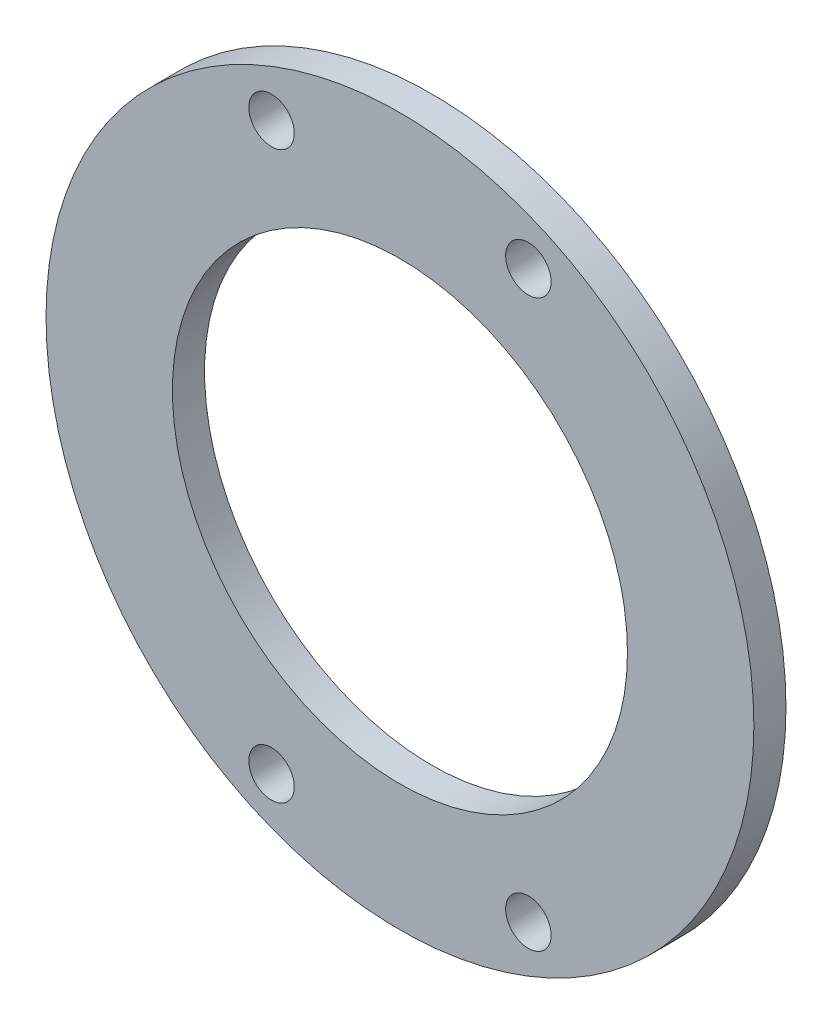
ISO-10303-21;
HEADER;
FILE_DESCRIPTION(('STEP AP214'),'2;1');
FILE_NAME('part.step','',(''),(''),'','','');
FILE_SCHEMA(('AUTOMOTIVE_DESIGN { 1 0 10303 214 1 1 1 1 }'));
ENDSEC;
DATA;
#1=APPLICATION_CONTEXT('core data for automotive mechanical design processes');
#2=APPLICATION_PROTOCOL_DEFINITION('international standard','automotive_design',2000,#1);
#3=PRODUCT_CONTEXT('',#1,'mechanical');
#4=PRODUCT('Part','Part','',(#3));
#5=PRODUCT_RELATED_PRODUCT_CATEGORY('part','',(#4));
#6=PRODUCT_DEFINITION_FORMATION('','',#4);
#7=PRODUCT_DEFINITION_CONTEXT('part definition',#1,'design');
#8=PRODUCT_DEFINITION('design','',#6,#7);
#9=PRODUCT_DEFINITION_SHAPE('','',#8);
#10=(LENGTH_UNIT() NAMED_UNIT(*) SI_UNIT(.MILLI.,.METRE.));
#11=(NAMED_UNIT(*) PLANE_ANGLE_UNIT() SI_UNIT($,.RADIAN.));
#12=(NAMED_UNIT(*) SI_UNIT($,.STERADIAN.) SOLID_ANGLE_UNIT());
#13=UNCERTAINTY_MEASURE_WITH_UNIT(LENGTH_MEASURE(1.E-05),#10,'distance_accuracy_value','');
#14=(GEOMETRIC_REPRESENTATION_CONTEXT(3) GLOBAL_UNCERTAINTY_ASSIGNED_CONTEXT((#13)) GLOBAL_UNIT_ASSIGNED_CONTEXT((#10,
#11,#12)) REPRESENTATION_CONTEXT('',''));
#15=CARTESIAN_POINT('',(0.,0.,0.));
#16=DIRECTION('',(0.,0.,1.));
#17=DIRECTION('',(1.,0.,0.));
#18=AXIS2_PLACEMENT_3D('',#15,#16,#17);
#19=CARTESIAN_POINT('',(0.,0.,3.175));
#20=DIRECTION('',(0.,0.,1.));
#21=DIRECTION('',(1.,0.,0.));
#22=AXIS2_PLACEMENT_3D('',#19,#20,#21);
#23=PLANE('',#22);
#24=CARTESIAN_POINT('',(12.7,27.9796875,3.175));
#25=DIRECTION('',(0.,0.,-1.));
#26=DIRECTION('',(-1.,0.,0.));
#27=AXIS2_PLACEMENT_3D('',#24,#25,#26);
#28=CIRCLE('',#27,2.25);
#29=CARTESIAN_POINT('',(10.45,27.9796875,3.175));
#30=VERTEX_POINT('',#29);
#31=EDGE_CURVE('E73',#30,#30,#28,.T.);
#32=ORIENTED_EDGE('',*,*,#31,.T.);
#33=EDGE_LOOP('',(#32));
#34=FACE_BOUND('',#33,.T.);
#35=CARTESIAN_POINT('',(-12.7,27.9796875,3.175));
#36=DIRECTION('',(0.,0.,-1.));
#37=DIRECTION('',(-1.,0.,0.));
#38=AXIS2_PLACEMENT_3D('',#35,#36,#37);
#39=CIRCLE('',#38,2.25);
#40=CARTESIAN_POINT('',(-14.95,27.9796875,3.175));
#41=VERTEX_POINT('',#40);
#42=EDGE_CURVE('E67',#41,#41,#39,.T.);
#43=ORIENTED_EDGE('',*,*,#42,.T.);
#44=EDGE_LOOP('',(#43));
#45=FACE_BOUND('',#44,.T.);
#46=CARTESIAN_POINT('',(-12.7,-27.9796875,3.175));
#47=DIRECTION('',(0.,0.,-1.));
#48=DIRECTION('',(-1.,0.,0.));
#49=AXIS2_PLACEMENT_3D('',#46,#47,#48);
#50=CIRCLE('',#49,2.25);
#51=CARTESIAN_POINT('',(-14.95,-27.9796875,3.175));
#52=VERTEX_POINT('',#51);
#53=EDGE_CURVE('E61',#52,#52,#50,.T.);
#54=ORIENTED_EDGE('',*,*,#53,.T.);
#55=EDGE_LOOP('',(#54));
#56=FACE_BOUND('',#55,.T.);
#57=CARTESIAN_POINT('',(12.7,-27.9796875,3.175));
#58=DIRECTION('',(0.,0.,-1.));
#59=DIRECTION('',(-1.,0.,0.));
#60=AXIS2_PLACEMENT_3D('',#57,#58,#59);
#61=CIRCLE('',#60,2.25);
#62=CARTESIAN_POINT('',(10.45,-27.9796875,3.175));
#63=VERTEX_POINT('',#62);
#64=EDGE_CURVE('E53',#63,#63,#61,.T.);
#65=ORIENTED_EDGE('',*,*,#64,.T.);
#66=EDGE_LOOP('',(#65));
#67=FACE_BOUND('',#66,.T.);
#68=CARTESIAN_POINT('',(0.,0.,3.175));
#69=DIRECTION('',(0.,0.,1.));
#70=DIRECTION('',(1.,0.,0.));
#71=AXIS2_PLACEMENT_3D('',#68,#69,#70);
#72=CIRCLE('',#71,35.);
#73=CARTESIAN_POINT('',(35.,0.,3.175));
#74=VERTEX_POINT('',#73);
#75=EDGE_CURVE('E10',#74,#74,#72,.T.);
#76=ORIENTED_EDGE('',*,*,#75,.T.);
#77=EDGE_LOOP('',(#76));
#78=FACE_BOUND('',#77,.T.);
#79=CARTESIAN_POINT('',(0.,0.,3.175));
#80=DIRECTION('',(0.,0.,1.));
#81=DIRECTION('',(1.,0.,0.));
#82=AXIS2_PLACEMENT_3D('',#79,#80,#81);
#83=CIRCLE('',#82,22.5);
#84=CARTESIAN_POINT('',(22.5,0.,3.175));
#85=VERTEX_POINT('',#84);
#86=EDGE_CURVE('E48',#85,#85,#83,.T.);
#87=ORIENTED_EDGE('',*,*,#86,.F.);
#88=EDGE_LOOP('',(#87));
#89=FACE_BOUND('',#88,.T.);
#90=ADVANCED_FACE('F37',(#34,#45,#56,#67,#78,#89),#23,.T.);
#91=CARTESIAN_POINT('',(0.,0.,0.));
#92=DIRECTION('',(0.,0.,1.));
#93=DIRECTION('',(1.,0.,0.));
#94=AXIS2_PLACEMENT_3D('',#91,#92,#93);
#95=PLANE('',#94);
#96=CARTESIAN_POINT('',(12.7,27.9796875,0.));
#97=DIRECTION('',(0.,0.,-1.));
#98=DIRECTION('',(-1.,0.,0.));
#99=AXIS2_PLACEMENT_3D('',#96,#97,#98);
#100=CIRCLE('',#99,2.25);
#101=CARTESIAN_POINT('',(10.45,27.9796875,0.));
#102=VERTEX_POINT('',#101);
#103=EDGE_CURVE('E76',#102,#102,#100,.T.);
#104=ORIENTED_EDGE('',*,*,#103,.F.);
#105=EDGE_LOOP('',(#104));
#106=FACE_BOUND('',#105,.T.);
#107=CARTESIAN_POINT('',(-12.7,27.9796875,0.));
#108=DIRECTION('',(0.,0.,-1.));
#109=DIRECTION('',(-1.,0.,0.));
#110=AXIS2_PLACEMENT_3D('',#107,#108,#109);
#111=CIRCLE('',#110,2.25);
#112=CARTESIAN_POINT('',(-14.95,27.9796875,0.));
#113=VERTEX_POINT('',#112);
#114=EDGE_CURVE('E70',#113,#113,#111,.T.);
#115=ORIENTED_EDGE('',*,*,#114,.F.);
#116=EDGE_LOOP('',(#115));
#117=FACE_BOUND('',#116,.T.);
#118=CARTESIAN_POINT('',(-12.7,-27.9796875,0.));
#119=DIRECTION('',(0.,0.,-1.));
#120=DIRECTION('',(-1.,0.,0.));
#121=AXIS2_PLACEMENT_3D('',#118,#119,#120);
#122=CIRCLE('',#121,2.25);
#123=CARTESIAN_POINT('',(-14.95,-27.9796875,0.));
#124=VERTEX_POINT('',#123);
#125=EDGE_CURVE('E64',#124,#124,#122,.T.);
#126=ORIENTED_EDGE('',*,*,#125,.F.);
#127=EDGE_LOOP('',(#126));
#128=FACE_BOUND('',#127,.T.);
#129=CARTESIAN_POINT('',(12.7,-27.9796875,0.));
#130=DIRECTION('',(0.,0.,-1.));
#131=DIRECTION('',(-1.,0.,0.));
#132=AXIS2_PLACEMENT_3D('',#129,#130,#131);
#133=CIRCLE('',#132,2.25);
#134=CARTESIAN_POINT('',(10.45,-27.9796875,0.));
#135=VERTEX_POINT('',#134);
#136=EDGE_CURVE('E58',#135,#135,#133,.T.);
#137=ORIENTED_EDGE('',*,*,#136,.F.);
#138=EDGE_LOOP('',(#137));
#139=FACE_BOUND('',#138,.T.);
#140=CARTESIAN_POINT('',(0.,0.,0.));
#141=DIRECTION('',(0.,0.,1.));
#142=DIRECTION('',(1.,0.,0.));
#143=AXIS2_PLACEMENT_3D('',#140,#141,#142);
#144=CIRCLE('',#143,35.);
#145=CARTESIAN_POINT('',(35.,0.,0.));
#146=VERTEX_POINT('',#145);
#147=EDGE_CURVE('E41',#146,#146,#144,.T.);
#148=ORIENTED_EDGE('',*,*,#147,.F.);
#149=EDGE_LOOP('',(#148));
#150=FACE_BOUND('',#149,.T.);
#151=CARTESIAN_POINT('',(0.,0.,0.));
#152=DIRECTION('',(0.,0.,1.));
#153=DIRECTION('',(1.,0.,0.));
#154=AXIS2_PLACEMENT_3D('',#151,#152,#153);
#155=CIRCLE('',#154,22.5);
#156=CARTESIAN_POINT('',(22.5,0.,0.));
#157=VERTEX_POINT('',#156);
#158=EDGE_CURVE('E50',#157,#157,#155,.T.);
#159=ORIENTED_EDGE('',*,*,#158,.T.);
#160=EDGE_LOOP('',(#159));
#161=FACE_BOUND('',#160,.T.);
#162=ADVANCED_FACE('F82',(#106,#117,#128,#139,#150,#161),#95,.F.);
#163=CARTESIAN_POINT('',(0.,0.,3.175));
#164=DIRECTION('',(0.,0.,-1.));
#165=DIRECTION('',(-1.,0.,0.));
#166=AXIS2_PLACEMENT_3D('',#163,#164,#165);
#167=CYLINDRICAL_SURFACE('',#166,35.);
#168=ORIENTED_EDGE('',*,*,#75,.F.);
#169=EDGE_LOOP('',(#168));
#170=FACE_BOUND('',#169,.T.);
#171=ORIENTED_EDGE('',*,*,#147,.T.);
#172=EDGE_LOOP('',(#171));
#173=FACE_BOUND('',#172,.T.);
#174=ADVANCED_FACE('F39',(#170,#173),#167,.T.);
#175=CARTESIAN_POINT('',(0.,0.,3.175));
#176=DIRECTION('',(0.,0.,-1.));
#177=DIRECTION('',(-1.,0.,0.));
#178=AXIS2_PLACEMENT_3D('',#175,#176,#177);
#179=CYLINDRICAL_SURFACE('',#178,22.5);
#180=ORIENTED_EDGE('',*,*,#86,.T.);
#181=EDGE_LOOP('',(#180));
#182=FACE_BOUND('',#181,.T.);
#183=ORIENTED_EDGE('',*,*,#158,.F.);
#184=EDGE_LOOP('',(#183));
#185=FACE_BOUND('',#184,.T.);
#186=ADVANCED_FACE('F95',(#182,#185),#179,.F.);
#187=CARTESIAN_POINT('',(12.7,-27.9796875,0.));
#188=DIRECTION('',(0.,0.,-1.));
#189=DIRECTION('',(-1.,0.,0.));
#190=AXIS2_PLACEMENT_3D('',#187,#188,#189);
#191=CYLINDRICAL_SURFACE('',#190,2.25);
#192=ORIENTED_EDGE('',*,*,#64,.F.);
#193=EDGE_LOOP('',(#192));
#194=FACE_BOUND('',#193,.T.);
#195=ORIENTED_EDGE('',*,*,#136,.T.);
#196=EDGE_LOOP('',(#195));
#197=FACE_BOUND('',#196,.T.);
#198=ADVANCED_FACE('F97',(#194,#197),#191,.F.);
#199=CARTESIAN_POINT('',(-12.7,-27.9796875,0.));
#200=DIRECTION('',(0.,0.,-1.));
#201=DIRECTION('',(-1.,0.,0.));
#202=AXIS2_PLACEMENT_3D('',#199,#200,#201);
#203=CYLINDRICAL_SURFACE('',#202,2.25);
#204=ORIENTED_EDGE('',*,*,#53,.F.);
#205=EDGE_LOOP('',(#204));
#206=FACE_BOUND('',#205,.T.);
#207=ORIENTED_EDGE('',*,*,#125,.T.);
#208=EDGE_LOOP('',(#207));
#209=FACE_BOUND('',#208,.T.);
#210=ADVANCED_FACE('F105',(#206,#209),#203,.F.);
#211=CARTESIAN_POINT('',(-12.7,27.9796875,0.));
#212=DIRECTION('',(0.,0.,-1.));
#213=DIRECTION('',(-1.,0.,0.));
#214=AXIS2_PLACEMENT_3D('',#211,#212,#213);
#215=CYLINDRICAL_SURFACE('',#214,2.25);
#216=ORIENTED_EDGE('',*,*,#42,.F.);
#217=EDGE_LOOP('',(#216));
#218=FACE_BOUND('',#217,.T.);
#219=ORIENTED_EDGE('',*,*,#114,.T.);
#220=EDGE_LOOP('',(#219));
#221=FACE_BOUND('',#220,.T.);
#222=ADVANCED_FACE('F126',(#218,#221),#215,.F.);
#223=CARTESIAN_POINT('',(12.7,27.9796875,0.));
#224=DIRECTION('',(0.,0.,-1.));
#225=DIRECTION('',(-1.,0.,0.));
#226=AXIS2_PLACEMENT_3D('',#223,#224,#225);
#227=CYLINDRICAL_SURFACE('',#226,2.25);
#228=ORIENTED_EDGE('',*,*,#31,.F.);
#229=EDGE_LOOP('',(#228));
#230=FACE_BOUND('',#229,.T.);
#231=ORIENTED_EDGE('',*,*,#103,.T.);
#232=EDGE_LOOP('',(#231));
#233=FACE_BOUND('',#232,.T.);
#234=ADVANCED_FACE('F80',(#230,#233),#227,.F.);
#235=CLOSED_SHELL('',(#90,#162,#174,#186,#198,#210,#222,#234));
#236=MANIFOLD_SOLID_BREP('B2',#235);
#237=ADVANCED_BREP_SHAPE_REPRESENTATION('',(#18,#236),#14);
#238=SHAPE_DEFINITION_REPRESENTATION(#9,#237);
ENDSEC;
END-ISO-10303-21;
